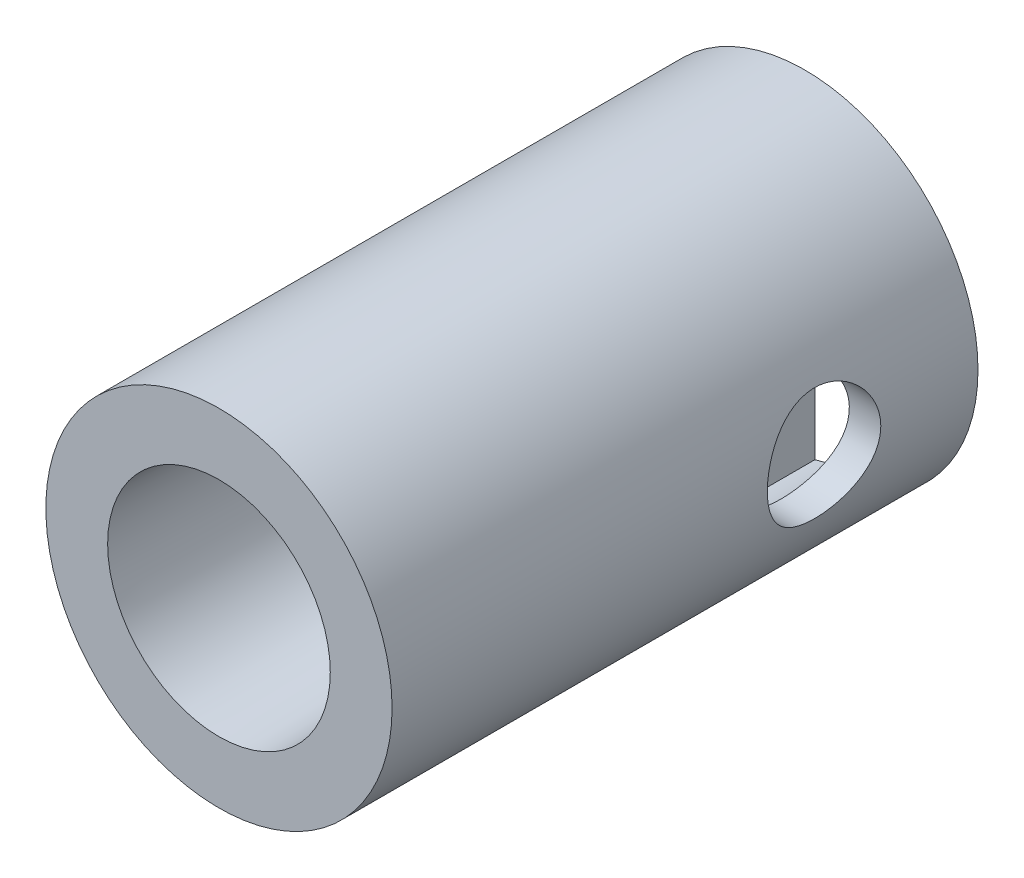
ISO-10303-21;
HEADER;
FILE_DESCRIPTION(('STEP AP214'),'2;1');
FILE_NAME('part.step','',(''),(''),'','','');
FILE_SCHEMA(('AUTOMOTIVE_DESIGN { 1 0 10303 214 1 1 1 1 }'));
ENDSEC;
DATA;
#1=APPLICATION_CONTEXT('core data for automotive mechanical design processes');
#2=APPLICATION_PROTOCOL_DEFINITION('international standard','automotive_design',2000,#1);
#3=PRODUCT_CONTEXT('',#1,'mechanical');
#4=PRODUCT('Part','Part','',(#3));
#5=PRODUCT_RELATED_PRODUCT_CATEGORY('part','',(#4));
#6=PRODUCT_DEFINITION_FORMATION('','',#4);
#7=PRODUCT_DEFINITION_CONTEXT('part definition',#1,'design');
#8=PRODUCT_DEFINITION('design','',#6,#7);
#9=PRODUCT_DEFINITION_SHAPE('','',#8);
#10=(LENGTH_UNIT() NAMED_UNIT(*) SI_UNIT(.MILLI.,.METRE.));
#11=(NAMED_UNIT(*) PLANE_ANGLE_UNIT() SI_UNIT($,.RADIAN.));
#12=(NAMED_UNIT(*) SI_UNIT($,.STERADIAN.) SOLID_ANGLE_UNIT());
#13=UNCERTAINTY_MEASURE_WITH_UNIT(LENGTH_MEASURE(1.E-05),#10,'distance_accuracy_value','');
#14=(GEOMETRIC_REPRESENTATION_CONTEXT(3) GLOBAL_UNCERTAINTY_ASSIGNED_CONTEXT((#13)) GLOBAL_UNIT_ASSIGNED_CONTEXT((#10,
#11,#12)) REPRESENTATION_CONTEXT('',''));
#15=CARTESIAN_POINT('',(0.,0.,0.));
#16=DIRECTION('',(0.,0.,1.));
#17=DIRECTION('',(1.,0.,0.));
#18=AXIS2_PLACEMENT_3D('',#15,#16,#17);
#19=CARTESIAN_POINT('',(0.,0.,-7.62));
#20=DIRECTION('',(0.,0.,1.));
#21=DIRECTION('',(1.,0.,0.));
#22=AXIS2_PLACEMENT_3D('',#19,#20,#21);
#23=CYLINDRICAL_SURFACE('',#22,4.1275);
#24=CARTESIAN_POINT('',(4.1275,0.,-2.59745000000002));
#25=CARTESIAN_POINT('',(4.12750003377303,-0.0738699150357999,-2.59744989833106));
#26=CARTESIAN_POINT('',(4.12549851751913,-0.147739742968134,-2.60352140105543));
#27=CARTESIAN_POINT('',(4.11771093203486,-0.293307842141043,-2.62757563364865));
#28=CARTESIAN_POINT('',(4.11192434338906,-0.365005813930477,-2.64555999829219));
#29=CARTESIAN_POINT('',(4.09719631094705,-0.504110449547072,-2.69276029126061));
#30=CARTESIAN_POINT('',(4.08826003607509,-0.57152393194815,-2.72195782473892));
#31=CARTESIAN_POINT('',(4.06814766170301,-0.700497479140865,-2.79067384573419));
#32=CARTESIAN_POINT('',(4.05697114409457,-0.762056448106838,-2.83019426028284));
#33=CARTESIAN_POINT('',(4.03313723386036,-0.879642319343135,-2.9198299187299));
#34=CARTESIAN_POINT('',(4.02044524001777,-0.93544517836053,-2.97022981851224));
#35=CARTESIAN_POINT('',(3.99520394513136,-1.03797650568563,-3.07958833431013));
#36=CARTESIAN_POINT('',(3.98265467463945,-1.08470306426882,-3.13854874697391));
#37=CARTESIAN_POINT('',(3.95874161721219,-1.16901645282055,-3.26535014716955));
#38=CARTESIAN_POINT('',(3.94742014742756,-1.20631519306968,-3.33339143948426));
#39=CARTESIAN_POINT('',(3.92776908425933,-1.2688453208089,-3.47521200419348));
#40=CARTESIAN_POINT('',(3.91943861293821,-1.29408025007018,-3.54898958508689));
#41=CARTESIAN_POINT('',(3.90707642970345,-1.33093164517486,-3.69764597428655));
#42=CARTESIAN_POINT('',(3.90291295160255,-1.34296678429838,-3.77240971787548));
#43=CARTESIAN_POINT('',(3.89896600281,-1.35438558026996,-3.92300232181736));
#44=CARTESIAN_POINT('',(3.89918123207651,-1.35377299223789,-3.99883085935065));
#45=CARTESIAN_POINT('',(3.90385167568759,-1.34023945235267,-4.14586006535332));
#46=CARTESIAN_POINT('',(3.90812003884548,-1.32786089210651,-4.2171176158935));
#47=CARTESIAN_POINT('',(3.92011067542915,-1.29203011633045,-4.35648249864518));
#48=CARTESIAN_POINT('',(3.92783334942604,-1.26857661650342,-4.42458946449547));
#49=CARTESIAN_POINT('',(3.94599835042475,-1.21089901764405,-4.55696862624955));
#50=CARTESIAN_POINT('',(3.95648147908106,-1.1765115742628,-4.6211638125087));
#51=CARTESIAN_POINT('',(3.97896867021257,-1.09805562115887,-4.74304590103678));
#52=CARTESIAN_POINT('',(3.99097315964902,-1.05398439117884,-4.80073096765264));
#53=CARTESIAN_POINT('',(4.01588959164268,-0.954791266338912,-4.91100838577247));
#54=CARTESIAN_POINT('',(4.02881679311061,-0.899224729328923,-4.96319813452945));
#55=CARTESIAN_POINT('',(4.05359219233949,-0.779968526733568,-5.05762152278044));
#56=CARTESIAN_POINT('',(4.06544029339174,-0.716278134315884,-5.09985427046844));
#57=CARTESIAN_POINT('',(4.08686910256143,-0.581749904505833,-5.17347454716784));
#58=CARTESIAN_POINT('',(4.09642768407982,-0.510851068262228,-5.20475749232888));
#59=CARTESIAN_POINT('',(4.11204011774203,-0.364409666868883,-5.25482932174091));
#60=CARTESIAN_POINT('',(4.11809514465749,-0.288868667685124,-5.27362239426678));
#61=CARTESIAN_POINT('',(4.12582515760304,-0.138698097383655,-5.29747536514225));
#62=CARTESIAN_POINT('',(4.12767363211271,-0.0641637925669669,-5.30307955832262));
#63=CARTESIAN_POINT('',(4.12730059175535,0.0847929999539967,-5.30194178104689));
#64=CARTESIAN_POINT('',(4.12507973793907,0.15921550385449,-5.29520181586411));
#65=CARTESIAN_POINT('',(4.11693197006697,0.303679521169446,-5.26999954954156));
#66=CARTESIAN_POINT('',(4.11110985494714,0.373785312850685,-5.25186850914119));
#67=CARTESIAN_POINT('',(4.0964515888879,0.509934183004496,-5.20481016898131));
#68=CARTESIAN_POINT('',(4.0876150563292,0.575976745830183,-5.17588150221994));
#69=CARTESIAN_POINT('',(4.06754459175,0.704022872399804,-5.10721951416896));
#70=CARTESIAN_POINT('',(4.05625468135755,0.765878240951156,-5.06722665330281));
#71=CARTESIAN_POINT('',(4.03256066801579,0.882178568603146,-4.97787818430306));
#72=CARTESIAN_POINT('',(4.02015623561259,0.936621324485693,-4.92851980288604));
#73=CARTESIAN_POINT('',(3.99494340875978,1.0390325205673,-4.81928107104091));
#74=CARTESIAN_POINT('',(3.98214113699842,1.08661262666917,-4.75903437647707));
#75=CARTESIAN_POINT('',(3.95814009409445,1.17103193604351,-4.6311357609411));
#76=CARTESIAN_POINT('',(3.9469413242912,1.20787113034444,-4.56348383378368));
#77=CARTESIAN_POINT('',(3.92752955296204,1.26957379868481,-4.42271720062233));
#78=CARTESIAN_POINT('',(3.91930881643272,1.29446835261068,-4.34961724995341));
#79=CARTESIAN_POINT('',(3.90688914995954,1.33148868898019,-4.19993307948466));
#80=CARTESIAN_POINT('',(3.90268848803524,1.34361997048565,-4.12335037508017));
#81=CARTESIAN_POINT('',(3.8989770648129,1.35434961350547,-3.97296737370933));
#82=CARTESIAN_POINT('',(3.89924365730875,1.35359040581163,-3.8992178828503));
#83=CARTESIAN_POINT('',(3.90388887279209,1.3401333583877,-3.75295497524842));
#84=CARTESIAN_POINT('',(3.90826726641492,1.32743618458173,-3.68044148978837));
#85=CARTESIAN_POINT('',(3.92047971300071,1.29091178098353,-3.53998399867842));
#86=CARTESIAN_POINT('',(3.92825112226203,1.26728587366939,-3.47198177180556));
#87=CARTESIAN_POINT('',(3.946352726057,1.20973637764597,-3.34085366950138));
#88=CARTESIAN_POINT('',(3.95668347611173,1.17581055291357,-3.27772885665118));
#89=CARTESIAN_POINT('',(3.9792861338334,1.09694412929086,-3.15524649721674));
#90=CARTESIAN_POINT('',(3.99162178931489,1.0515973803027,-3.09616229395152));
#91=CARTESIAN_POINT('',(4.016570318055,0.951870655228976,-2.98623438247757));
#92=CARTESIAN_POINT('',(4.02918326764065,0.897488164285621,-2.93539297623691));
#93=CARTESIAN_POINT('',(4.05382815464096,0.778804109728653,-2.8414919329818));
#94=CARTESIAN_POINT('',(4.06582104978419,0.714208912589858,-2.79879193864743));
#95=CARTESIAN_POINT('',(4.08735441946401,0.578367883935806,-2.72490605244016));
#96=CARTESIAN_POINT('',(4.09689561621736,0.507124019422043,-2.69371676857982));
#97=CARTESIAN_POINT('',(4.11200271625694,0.36409938000074,-2.64531573874334));
#98=CARTESIAN_POINT('',(4.11776052450886,0.292569784741452,-2.6274219105106));
#99=CARTESIAN_POINT('',(4.12550867074236,0.147359729749985,-2.6034905986324));
#100=CARTESIAN_POINT('',(4.12749996631388,0.0736798215471191,-2.59745010140734));
#101=CARTESIAN_POINT('',(4.1275,0.,-2.59745000000002));
#102=B_SPLINE_CURVE_WITH_KNOTS('',3,(#24,#25,#26,#27,#28,#29,#30,#31,#32,#33,#34,#35,#36,#37,
#38,#39,#40,#41,#42,#43,#44,#45,#46,#47,#48,#49,#50,#51,#52,#53,#54,#55,#56,#57,#58,#59,#60,#61,
#62,#63,#64,#65,#66,#67,#68,#69,#70,#71,#72,#73,#74,#75,#76,#77,#78,#79,#80,#81,#82,#83,#84,#85,
#86,#87,#88,#89,#90,#91,#92,#93,#94,#95,#96,#97,#98,#99,#100,#101),.UNSPECIFIED.,.T.,.F.,(4,2,2,
2,2,2,2,2,2,2,2,2,2,2,2,2,2,2,2,2,2,2,2,2,2,2,2,2,2,2,2,2,2,2,2,2,2,2,4),(0.,0.221338694739596,
0.442707769574037,0.663715236079267,0.88476398884369,1.1125082505086,1.34030037956122,
1.57438421247804,1.80839927928949,2.03475554212225,2.26104460057435,2.47738357360788,
2.69374764039304,2.91350920510758,3.13333258180058,3.36422297319685,3.59513403660882,
3.82819397466244,4.06117572038448,4.28435972454561,4.5075074763176,4.72444856839691,
4.94141713498862,5.16398431933184,5.38661751259313,5.61900825462208,5.85139919075892,
6.08318212298764,6.3148651504857,6.53503710197037,6.755196772543,6.97145310356351,
7.18775641557654,7.41323402266546,7.63877449087985,7.87270125125047,8.1065590227084,
8.32738428417254,8.54815339595482),.UNSPECIFIED.);
#103=CARTESIAN_POINT('',(4.1275,0.,-2.59745000000002));
#104=VERTEX_POINT('',#103);
#105=EDGE_CURVE('E136',#104,#104,#102,.T.);
#106=ORIENTED_EDGE('',*,*,#105,.F.);
#107=EDGE_LOOP('',(#106));
#108=FACE_BOUND('',#107,.T.);
#109=CARTESIAN_POINT('',(-4.1275,0.,-2.59745000000002));
#110=CARTESIAN_POINT('',(-4.12750003377303,0.0738699150357999,-2.59744989833106));
#111=CARTESIAN_POINT('',(-4.12549851751913,0.147739742968134,-2.60352140105543));
#112=CARTESIAN_POINT('',(-4.11771093203486,0.293307842141043,-2.62757563364865));
#113=CARTESIAN_POINT('',(-4.11192434338906,0.365005813930477,-2.64555999829219));
#114=CARTESIAN_POINT('',(-4.09719631094705,0.504110449547072,-2.69276029126061));
#115=CARTESIAN_POINT('',(-4.08826003607509,0.57152393194815,-2.72195782473892));
#116=CARTESIAN_POINT('',(-4.06814766170301,0.700497479140865,-2.79067384573419));
#117=CARTESIAN_POINT('',(-4.05697114409457,0.762056448106837,-2.83019426028284));
#118=CARTESIAN_POINT('',(-4.03313723386036,0.879642319343135,-2.9198299187299));
#119=CARTESIAN_POINT('',(-4.02044524001777,0.93544517836053,-2.97022981851224));
#120=CARTESIAN_POINT('',(-3.99520394513136,1.03797650568563,-3.07958833431013));
#121=CARTESIAN_POINT('',(-3.98265467463945,1.08470306426882,-3.13854874697391));
#122=CARTESIAN_POINT('',(-3.95874161721219,1.16901645282055,-3.26535014716955));
#123=CARTESIAN_POINT('',(-3.94742014742756,1.20631519306968,-3.33339143948426));
#124=CARTESIAN_POINT('',(-3.92776908425933,1.2688453208089,-3.47521200419348));
#125=CARTESIAN_POINT('',(-3.91943861293821,1.29408025007018,-3.54898958508689));
#126=CARTESIAN_POINT('',(-3.90707642970345,1.33093164517486,-3.69764597428655));
#127=CARTESIAN_POINT('',(-3.90291295160255,1.34296678429838,-3.77240971787548));
#128=CARTESIAN_POINT('',(-3.89896600281,1.35438558026996,-3.92300232181736));
#129=CARTESIAN_POINT('',(-3.89918123207651,1.35377299223789,-3.99883085935065));
#130=CARTESIAN_POINT('',(-3.90385167568759,1.34023945235267,-4.14586006535332));
#131=CARTESIAN_POINT('',(-3.90812003884548,1.32786089210651,-4.2171176158935));
#132=CARTESIAN_POINT('',(-3.92011067542914,1.29203011633045,-4.35648249864518));
#133=CARTESIAN_POINT('',(-3.92783334942604,1.26857661650342,-4.42458946449547));
#134=CARTESIAN_POINT('',(-3.94599835042475,1.21089901764405,-4.55696862624955));
#135=CARTESIAN_POINT('',(-3.95648147908106,1.1765115742628,-4.6211638125087));
#136=CARTESIAN_POINT('',(-3.97896867021257,1.09805562115887,-4.74304590103678));
#137=CARTESIAN_POINT('',(-3.99097315964902,1.05398439117884,-4.80073096765264));
#138=CARTESIAN_POINT('',(-4.01588959164268,0.954791266338913,-4.91100838577247));
#139=CARTESIAN_POINT('',(-4.02881679311061,0.899224729328923,-4.96319813452945));
#140=CARTESIAN_POINT('',(-4.05359219233949,0.779968526733569,-5.05762152278044));
#141=CARTESIAN_POINT('',(-4.06544029339174,0.716278134315884,-5.09985427046844));
#142=CARTESIAN_POINT('',(-4.08686910256143,0.581749904505834,-5.17347454716784));
#143=CARTESIAN_POINT('',(-4.09642768407982,0.510851068262229,-5.20475749232888));
#144=CARTESIAN_POINT('',(-4.11204011774203,0.364409666868885,-5.25482932174091));
#145=CARTESIAN_POINT('',(-4.11809514465749,0.288868667685125,-5.27362239426678));
#146=CARTESIAN_POINT('',(-4.12582515760304,0.138698097383656,-5.29747536514225));
#147=CARTESIAN_POINT('',(-4.12767363211271,0.0641637925669679,-5.30307955832262));
#148=CARTESIAN_POINT('',(-4.12730059175535,-0.0847929999539957,-5.30194178104689));
#149=CARTESIAN_POINT('',(-4.12507973793907,-0.159215503854489,-5.29520181586411));
#150=CARTESIAN_POINT('',(-4.11693197006697,-0.303679521169446,-5.26999954954156));
#151=CARTESIAN_POINT('',(-4.11110985494714,-0.373785312850685,-5.25186850914119));
#152=CARTESIAN_POINT('',(-4.0964515888879,-0.509934183004496,-5.20481016898131));
#153=CARTESIAN_POINT('',(-4.0876150563292,-0.575976745830183,-5.17588150221994));
#154=CARTESIAN_POINT('',(-4.06754459175,-0.704022872399804,-5.10721951416896));
#155=CARTESIAN_POINT('',(-4.05625468135755,-0.765878240951156,-5.06722665330281));
#156=CARTESIAN_POINT('',(-4.03256066801579,-0.882178568603145,-4.97787818430306));
#157=CARTESIAN_POINT('',(-4.02015623561259,-0.936621324485692,-4.92851980288604));
#158=CARTESIAN_POINT('',(-3.99494340875978,-1.0390325205673,-4.81928107104091));
#159=CARTESIAN_POINT('',(-3.98214113699842,-1.08661262666917,-4.75903437647707));
#160=CARTESIAN_POINT('',(-3.95814009409445,-1.17103193604351,-4.6311357609411));
#161=CARTESIAN_POINT('',(-3.9469413242912,-1.20787113034444,-4.56348383378368));
#162=CARTESIAN_POINT('',(-3.92752955296204,-1.26957379868481,-4.42271720062233));
#163=CARTESIAN_POINT('',(-3.91930881643272,-1.29446835261068,-4.34961724995341));
#164=CARTESIAN_POINT('',(-3.90688914995954,-1.33148868898019,-4.19993307948466));
#165=CARTESIAN_POINT('',(-3.90268848803524,-1.34361997048565,-4.12335037508017));
#166=CARTESIAN_POINT('',(-3.8989770648129,-1.35434961350547,-3.97296737370933));
#167=CARTESIAN_POINT('',(-3.89924365730875,-1.35359040581163,-3.8992178828503));
#168=CARTESIAN_POINT('',(-3.90388887279209,-1.3401333583877,-3.75295497524842));
#169=CARTESIAN_POINT('',(-3.90826726641492,-1.32743618458173,-3.68044148978837));
#170=CARTESIAN_POINT('',(-3.92047971300071,-1.29091178098353,-3.53998399867843));
#171=CARTESIAN_POINT('',(-3.92825112226203,-1.26728587366939,-3.47198177180556));
#172=CARTESIAN_POINT('',(-3.946352726057,-1.20973637764597,-3.34085366950138));
#173=CARTESIAN_POINT('',(-3.95668347611173,-1.17581055291357,-3.27772885665118));
#174=CARTESIAN_POINT('',(-3.9792861338334,-1.09694412929086,-3.15524649721674));
#175=CARTESIAN_POINT('',(-3.99162178931489,-1.0515973803027,-3.09616229395152));
#176=CARTESIAN_POINT('',(-4.016570318055,-0.951870655228977,-2.98623438247757));
#177=CARTESIAN_POINT('',(-4.02918326764065,-0.897488164285622,-2.93539297623691));
#178=CARTESIAN_POINT('',(-4.05382815464096,-0.778804109728654,-2.8414919329818));
#179=CARTESIAN_POINT('',(-4.06582104978419,-0.714208912589858,-2.79879193864743));
#180=CARTESIAN_POINT('',(-4.08735441946401,-0.578367883935806,-2.72490605244017));
#181=CARTESIAN_POINT('',(-4.09689561621736,-0.507124019422043,-2.69371676857982));
#182=CARTESIAN_POINT('',(-4.11200271625694,-0.36409938000074,-2.64531573874334));
#183=CARTESIAN_POINT('',(-4.11776052450886,-0.292569784741453,-2.6274219105106));
#184=CARTESIAN_POINT('',(-4.12550867074236,-0.147359729749986,-2.6034905986324));
#185=CARTESIAN_POINT('',(-4.12749996631388,-0.0736798215471197,-2.59745010140734));
#186=CARTESIAN_POINT('',(-4.1275,0.,-2.59745000000002));
#187=B_SPLINE_CURVE_WITH_KNOTS('',3,(#109,#110,#111,#112,#113,#114,#115,#116,#117,#118,#119,
#120,#121,#122,#123,#124,#125,#126,#127,#128,#129,#130,#131,#132,#133,#134,#135,#136,#137,#138,
#139,#140,#141,#142,#143,#144,#145,#146,#147,#148,#149,#150,#151,#152,#153,#154,#155,#156,#157,
#158,#159,#160,#161,#162,#163,#164,#165,#166,#167,#168,#169,#170,#171,#172,#173,#174,#175,#176,
#177,#178,#179,#180,#181,#182,#183,#184,#185,#186),.UNSPECIFIED.,.T.,.F.,(4,2,2,2,2,2,2,2,2,2,2,
2,2,2,2,2,2,2,2,2,2,2,2,2,2,2,2,2,2,2,2,2,2,2,2,2,2,2,4),(0.,0.221338694739596,
0.442707769574037,0.663715236079266,0.88476398884369,1.1125082505086,1.34030037956122,
1.57438421247804,1.80839927928949,2.03475554212225,2.26104460057435,2.47738357360788,
2.69374764039304,2.91350920510758,3.13333258180058,3.36422297319685,3.59513403660882,
3.82819397466244,4.06117572038448,4.28435972454561,4.5075074763176,4.72444856839691,
4.94141713498862,5.16398431933184,5.38661751259313,5.61900825462207,5.85139919075892,
6.08318212298764,6.3148651504857,6.53503710197037,6.755196772543,6.97145310356351,
7.18775641557654,7.41323402266546,7.63877449087985,7.87270125125047,8.1065590227084,
8.32738428417254,8.54815339595482),.UNSPECIFIED.);
#188=CARTESIAN_POINT('',(-4.1275,0.,-2.59745000000002));
#189=VERTEX_POINT('',#188);
#190=EDGE_CURVE('E128',#189,#189,#187,.T.);
#191=ORIENTED_EDGE('',*,*,#190,.F.);
#192=EDGE_LOOP('',(#191));
#193=FACE_BOUND('',#192,.T.);
#194=CARTESIAN_POINT('',(0.,0.,-7.62));
#195=DIRECTION('',(0.,0.,1.));
#196=DIRECTION('',(1.,0.,0.));
#197=AXIS2_PLACEMENT_3D('',#194,#195,#196);
#198=CIRCLE('',#197,4.1275);
#199=CARTESIAN_POINT('',(4.1275,0.,-7.62));
#200=VERTEX_POINT('',#199);
#201=EDGE_CURVE('E125',#200,#200,#198,.T.);
#202=ORIENTED_EDGE('',*,*,#201,.T.);
#203=EDGE_LOOP('',(#202));
#204=FACE_BOUND('',#203,.T.);
#205=CARTESIAN_POINT('',(0.,0.,6.35));
#206=DIRECTION('',(0.,0.,1.));
#207=DIRECTION('',(1.,0.,0.));
#208=AXIS2_PLACEMENT_3D('',#205,#206,#207);
#209=CIRCLE('',#208,4.1275);
#210=CARTESIAN_POINT('',(4.1275,0.,6.35));
#211=VERTEX_POINT('',#210);
#212=EDGE_CURVE('E120',#211,#211,#209,.T.);
#213=ORIENTED_EDGE('',*,*,#212,.F.);
#214=EDGE_LOOP('',(#213));
#215=FACE_BOUND('',#214,.T.);
#216=ADVANCED_FACE('F32',(#108,#193,#204,#215),#23,.T.);
#217=CARTESIAN_POINT('',(0.,0.,-7.62));
#218=DIRECTION('',(0.,0.,1.));
#219=DIRECTION('',(1.,0.,0.));
#220=AXIS2_PLACEMENT_3D('',#217,#218,#219);
#221=PLANE('',#220);
#222=DIRECTION('',(0.,-1.,0.));
#223=VECTOR('',#222,1.);
#224=CARTESIAN_POINT('',(0.237999999964339,0.,-7.62));
#225=LINE('',#224,#223);
#226=CARTESIAN_POINT('',(0.237999999964339,3.87805323324025,-7.62));
#227=VERTEX_POINT('',#226);
#228=CARTESIAN_POINT('',(0.237999999964339,-3.87805323324025,-7.62));
#229=VERTEX_POINT('',#228);
#230=EDGE_CURVE('E204',#227,#229,#225,.T.);
#231=ORIENTED_EDGE('',*,*,#230,.T.);
#232=CARTESIAN_POINT('',(0.,0.,-7.62));
#233=DIRECTION('',(0.,0.,1.));
#234=DIRECTION('',(1.,0.,0.));
#235=AXIS2_PLACEMENT_3D('',#232,#233,#234);
#236=CIRCLE('',#235,3.88534951836102);
#237=EDGE_CURVE('E254',#229,#227,#236,.T.);
#238=ORIENTED_EDGE('',*,*,#237,.T.);
#239=EDGE_LOOP('',(#231,#238));
#240=FACE_BOUND('',#239,.T.);
#241=DIRECTION('',(0.,1.,0.));
#242=VECTOR('',#241,1.);
#243=CARTESIAN_POINT('',(-0.237999999964365,0.,-7.62));
#244=LINE('',#243,#242);
#245=CARTESIAN_POINT('',(-0.237999999964334,-3.87805323324026,-7.62));
#246=VERTEX_POINT('',#245);
#247=CARTESIAN_POINT('',(-0.237999999964395,3.87805323324025,-7.62));
#248=VERTEX_POINT('',#247);
#249=EDGE_CURVE('E209',#246,#248,#244,.T.);
#250=ORIENTED_EDGE('',*,*,#249,.T.);
#251=CARTESIAN_POINT('',(0.,0.,-7.62));
#252=DIRECTION('',(0.,0.,1.));
#253=DIRECTION('',(1.,0.,0.));
#254=AXIS2_PLACEMENT_3D('',#251,#252,#253);
#255=CIRCLE('',#254,3.88534951836102);
#256=EDGE_CURVE('E215',#248,#246,#255,.T.);
#257=ORIENTED_EDGE('',*,*,#256,.T.);
#258=EDGE_LOOP('',(#250,#257));
#259=FACE_BOUND('',#258,.T.);
#260=ORIENTED_EDGE('',*,*,#201,.F.);
#261=EDGE_LOOP('',(#260));
#262=FACE_BOUND('',#261,.T.);
#263=ADVANCED_FACE('F193',(#240,#259,#262),#221,.F.);
#264=CARTESIAN_POINT('',(0.,0.,6.35));
#265=DIRECTION('',(0.,0.,1.));
#266=DIRECTION('',(1.,0.,0.));
#267=AXIS2_PLACEMENT_3D('',#264,#265,#266);
#268=PLANE('',#267);
#269=CARTESIAN_POINT('',(0.,0.,6.35));
#270=DIRECTION('',(0.,0.,1.));
#271=DIRECTION('',(1.,0.,0.));
#272=AXIS2_PLACEMENT_3D('',#269,#270,#271);
#273=CIRCLE('',#272,2.65430000000001);
#274=CARTESIAN_POINT('',(2.65430000000001,0.,6.35));
#275=VERTEX_POINT('',#274);
#276=EDGE_CURVE('E292',#275,#275,#273,.T.);
#277=ORIENTED_EDGE('',*,*,#276,.F.);
#278=EDGE_LOOP('',(#277));
#279=FACE_BOUND('',#278,.T.);
#280=ORIENTED_EDGE('',*,*,#212,.T.);
#281=EDGE_LOOP('',(#280));
#282=FACE_BOUND('',#281,.T.);
#283=ADVANCED_FACE('F190',(#279,#282),#268,.T.);
#284=CARTESIAN_POINT('',(0.,0.,0.254));
#285=DIRECTION('',(0.,0.,-1.));
#286=DIRECTION('',(-1.,0.,0.));
#287=AXIS2_PLACEMENT_3D('',#284,#285,#286);
#288=CYLINDRICAL_SURFACE('',#287,3.37734951836102);
#289=CARTESIAN_POINT('',(3.377349518361,0.,-2.59745000000002));
#290=CARTESIAN_POINT('',(3.37734455893801,-0.0726879603993307,-2.59745670113855));
#291=CARTESIAN_POINT('',(3.3749754121588,-0.145501754067376,-2.60334448081282));
#292=CARTESIAN_POINT('',(3.36572936472338,-0.289076594485013,-2.62669151385157));
#293=CARTESIAN_POINT('',(3.35884022376242,-0.359831520832319,-2.64418218970048));
#294=CARTESIAN_POINT('',(3.34129652057807,-0.496980445181198,-2.6899964328775));
#295=CARTESIAN_POINT('',(3.33065430669533,-0.563387907702961,-2.71828449951982));
#296=CARTESIAN_POINT('',(3.30665231843669,-0.690454122340064,-2.78474946593264));
#297=CARTESIAN_POINT('',(3.29329348433511,-0.751114852889425,-2.82292294541892));
#298=CARTESIAN_POINT('',(3.26450369417738,-0.867916269940759,-2.90997908626384));
#299=CARTESIAN_POINT('',(3.24900831952552,-0.92375024468204,-2.95925180316873));
#300=CARTESIAN_POINT('',(3.21798537494595,-1.02662193466756,-3.06628444009257));
#301=CARTESIAN_POINT('',(3.2024577929844,-1.07365533745846,-3.12404849640862));
#302=CARTESIAN_POINT('',(3.17235771440744,-1.15965848818485,-3.24955505023476));
#303=CARTESIAN_POINT('',(3.15785878299854,-1.19817461295903,-3.3176278523472));
#304=CARTESIAN_POINT('',(3.13246851019508,-1.26307336631158,-3.45995315227106));
#305=CARTESIAN_POINT('',(3.12157545194092,-1.28946177157609,-3.53420268802924));
#306=CARTESIAN_POINT('',(3.10532202021268,-1.32811486344044,-3.68324949588683));
#307=CARTESIAN_POINT('',(3.09973275290331,-1.3409667950175,-3.75786860010593));
#308=CARTESIAN_POINT('',(3.09405644239227,-1.35401641006485,-3.90839749040783));
#309=CARTESIAN_POINT('',(3.09396668457945,-1.35422033671345,-3.98430662121115));
#310=CARTESIAN_POINT('',(3.09910431962849,-1.34241311777812,-4.12961144040417));
#311=CARTESIAN_POINT('',(3.10396106465943,-1.33125347127481,-4.19909197476133));
#312=CARTESIAN_POINT('',(3.11782225522066,-1.29845590607337,-4.33509616875388));
#313=CARTESIAN_POINT('',(3.12682742639281,-1.27681615416334,-4.40161930884934));
#314=CARTESIAN_POINT('',(3.14816869294297,-1.22326042527972,-4.53142726378506));
#315=CARTESIAN_POINT('',(3.16056909533372,-1.19114349005044,-4.59461812402374));
#316=CARTESIAN_POINT('',(3.18728601810568,-1.11768619906507,-4.71494616313063));
#317=CARTESIAN_POINT('',(3.20160325840467,-1.07634237400319,-4.77208105300755));
#318=CARTESIAN_POINT('',(3.23189211543646,-0.981838697263378,-4.88333516384491));
#319=CARTESIAN_POINT('',(3.2479059515006,-0.928011406512404,-4.93687746372556));
#320=CARTESIAN_POINT('',(3.27884042419239,-0.81197158850267,-5.03436013426776));
#321=CARTESIAN_POINT('',(3.29376084166836,-0.749757387328972,-5.07829858352853));
#322=CARTESIAN_POINT('',(3.32120274920545,-0.617070059110083,-5.15608589110002));
#323=CARTESIAN_POINT('',(3.33367075218945,-0.546457526720523,-5.18971720027674));
#324=CARTESIAN_POINT('',(3.35439845224189,-0.399951162985777,-5.24442498392475));
#325=CARTESIAN_POINT('',(3.36266029205907,-0.324060043157601,-5.26550785188504));
#326=CARTESIAN_POINT('',(3.37365397449798,-0.173986150796277,-5.29335235146548));
#327=CARTESIAN_POINT('',(3.37668475846456,-0.0999690481255243,-5.3008892640588));
#328=CARTESIAN_POINT('',(3.37781686657482,0.0483272370038097,-5.30371775640456));
#329=CARTESIAN_POINT('',(3.37591947221926,0.122606346315279,-5.29901251954855));
#330=CARTESIAN_POINT('',(3.36760402876399,0.265800704340595,-5.27805989208292));
#331=CARTESIAN_POINT('',(3.36139353857108,0.334806830417992,-5.26234215905999));
#332=CARTESIAN_POINT('',(3.34529202924126,0.469138299907494,-5.22053186767743));
#333=CARTESIAN_POINT('',(3.33540053751274,0.534463169454749,-5.19443797712776));
#334=CARTESIAN_POINT('',(3.31252032133695,0.661827485340994,-5.13176468235937));
#335=CARTESIAN_POINT('',(3.29944607229388,0.723705197187519,-5.09488881449074));
#336=CARTESIAN_POINT('',(3.27161710342745,0.840611849377737,-5.01202717648234));
#337=CARTESIAN_POINT('',(3.25686171028516,0.895638027000915,-4.96603775075997));
#338=CARTESIAN_POINT('',(3.22606639965605,1.00109990496621,-4.86268551177141));
#339=CARTESIAN_POINT('',(3.2100060950471,1.05099085508512,-4.80477145447148));
#340=CARTESIAN_POINT('',(3.17931413420026,1.14048036041521,-4.68110997922347));
#341=CARTESIAN_POINT('',(3.1646827159886,1.1800772026368,-4.6153612602009));
#342=CARTESIAN_POINT('',(3.13848055415846,1.24810980091356,-4.47689474264165));
#343=CARTESIAN_POINT('',(3.12694123687643,1.27643228085826,-4.40411491662885));
#344=CARTESIAN_POINT('',(3.10871917236686,1.32019983034665,-4.25421726882825));
#345=CARTESIAN_POINT('',(3.10203282954142,1.33565443502844,-4.17710270441137));
#346=CARTESIAN_POINT('',(3.09479444357629,1.35233580550332,-4.02671648097907));
#347=CARTESIAN_POINT('',(3.09383483340287,1.35450815746289,-3.95356868126008));
#348=CARTESIAN_POINT('',(3.09709043239046,1.34704758507743,-3.80800234618639));
#349=CARTESIAN_POINT('',(3.10130498091472,1.33741616783836,-3.7355837189211));
#350=CARTESIAN_POINT('',(3.11407414223245,1.30739431537574,-3.59648017485822));
#351=CARTESIAN_POINT('',(3.12244965124639,1.28744658934238,-3.52968176867628));
#352=CARTESIAN_POINT('',(3.14247051794192,1.23777307432628,-3.40035345777146));
#353=CARTESIAN_POINT('',(3.15411677899986,1.20804458352277,-3.33782473826891));
#354=CARTESIAN_POINT('',(3.18019617446085,1.1376839528807,-3.21490420690596));
#355=CARTESIAN_POINT('',(3.19475082079299,1.09652432037331,-3.15484053807856));
#356=CARTESIAN_POINT('',(3.22463746723691,1.00523995824943,-3.04217592442501));
#357=CARTESIAN_POINT('',(3.23996970165881,0.955112514728799,-2.98957724737432));
#358=CARTESIAN_POINT('',(3.27088298930818,0.843433837835427,-2.889824080321));
#359=CARTESIAN_POINT('',(3.28641533954396,0.781351572511415,-2.84324637837205));
#360=CARTESIAN_POINT('',(3.31495983817834,0.649663743093335,-2.76115758288441));
#361=CARTESIAN_POINT('',(3.32797081438892,0.580054703114893,-2.72565163195825));
#362=CARTESIAN_POINT('',(3.34978749588014,0.436559671049308,-2.66754498726424));
#363=CARTESIAN_POINT('',(3.35866681625411,0.362777124687557,-2.6447168558467));
#364=CARTESIAN_POINT('',(3.37152173077164,0.212132812966788,-2.6119812773354));
#365=CARTESIAN_POINT('',(3.37551287872877,0.135281622075151,-2.60203284217653));
#366=CARTESIAN_POINT('',(3.37718331491618,0.0388424884196605,-2.59786645479086));
#367=CARTESIAN_POINT('',(3.37735084375864,0.0194257378217498,-2.59744820913177));
#368=CARTESIAN_POINT('',(3.377349518361,0.,-2.59745000000002));
#369=B_SPLINE_CURVE_WITH_KNOTS('',3,(#289,#290,#291,#292,#293,#294,#295,#296,#297,#298,#299,
#300,#301,#302,#303,#304,#305,#306,#307,#308,#309,#310,#311,#312,#313,#314,#315,#316,#317,#318,
#319,#320,#321,#322,#323,#324,#325,#326,#327,#328,#329,#330,#331,#332,#333,#334,#335,#336,#337,
#338,#339,#340,#341,#342,#343,#344,#345,#346,#347,#348,#349,#350,#351,#352,#353,#354,#355,#356,
#357,#358,#359,#360,#361,#362,#363,#364,#365,#366,#367,#368),.UNSPECIFIED.,.T.,.F.,(4,2,2,2,2,2,
2,2,2,2,2,2,2,2,2,2,2,2,2,2,2,2,2,2,2,2,2,2,2,2,2,2,2,2,2,2,2,2,2,4),(0.,0.218011892515729,
0.436616619362822,0.654508703274225,0.872325498530129,1.09951262502911,1.32681078780078,
1.564254368245,1.80158473183413,2.02813181953245,2.2545670804931,2.4651993791866,
2.67586853563718,2.89084271907539,3.10589786928513,3.3376205237805,3.56938949567532,
3.80575825939139,4.04200648880413,4.26424181348107,4.48641935489464,4.69858530505068,
4.91077850389353,5.12946577447911,5.34824094196265,5.58149371405557,5.81478527573461,
6.05036494317557,6.28576988955526,6.50420020974514,6.72260264364409,6.93232699228293,
7.14210932350715,7.36392116179602,7.58580024029735,7.82211385753634,8.0585370749086,
8.29056927914038,8.52186123918699,8.58012455876244),.UNSPECIFIED.);
#370=CARTESIAN_POINT('',(3.377349518361,0.,-2.59745000000002));
#371=VERTEX_POINT('',#370);
#372=EDGE_CURVE('E167',#371,#371,#369,.T.);
#373=ORIENTED_EDGE('',*,*,#372,.T.);
#374=EDGE_LOOP('',(#373));
#375=FACE_BOUND('',#374,.T.);
#376=DIRECTION('',(0.,0.,-1.));
#377=VECTOR('',#376,1.);
#378=CARTESIAN_POINT('',(0.745999999964338,3.29392983671884,0.254));
#379=LINE('',#378,#377);
#380=CARTESIAN_POINT('',(0.745999999964338,3.29392983671884,0.254));
#381=VERTEX_POINT('',#380);
#382=CARTESIAN_POINT('',(0.745999999964338,3.29392983671884,-7.112));
#383=VERTEX_POINT('',#382);
#384=EDGE_CURVE('E117',#381,#383,#379,.T.);
#385=ORIENTED_EDGE('',*,*,#384,.T.);
#386=CARTESIAN_POINT('',(0.,0.,-7.112));
#387=DIRECTION('',(0.,0.,1.));
#388=DIRECTION('',(1.,0.,0.));
#389=AXIS2_PLACEMENT_3D('',#386,#387,#388);
#390=CIRCLE('',#389,3.37734951836102);
#391=CARTESIAN_POINT('',(0.745999999964338,-3.29392983671884,-7.112));
#392=VERTEX_POINT('',#391);
#393=EDGE_CURVE('E218',#383,#392,#390,.F.);
#394=ORIENTED_EDGE('',*,*,#393,.T.);
#395=DIRECTION('',(0.,0.,-1.));
#396=VECTOR('',#395,1.);
#397=CARTESIAN_POINT('',(0.745999999964338,-3.29392983671884,0.254));
#398=LINE('',#397,#396);
#399=CARTESIAN_POINT('',(0.745999999964338,-3.29392983671884,0.254));
#400=VERTEX_POINT('',#399);
#401=EDGE_CURVE('E116',#400,#392,#398,.T.);
#402=ORIENTED_EDGE('',*,*,#401,.F.);
#403=CARTESIAN_POINT('',(0.,0.,0.254));
#404=DIRECTION('',(0.,0.,-1.));
#405=DIRECTION('',(-1.,0.,0.));
#406=AXIS2_PLACEMENT_3D('',#403,#404,#405);
#407=CIRCLE('',#406,3.37734951836102);
#408=EDGE_CURVE('E109',#381,#400,#407,.T.);
#409=ORIENTED_EDGE('',*,*,#408,.F.);
#410=EDGE_LOOP('',(#385,#394,#402,#409));
#411=FACE_BOUND('',#410,.T.);
#412=ADVANCED_FACE('F185',(#375,#411),#288,.F.);
#413=CARTESIAN_POINT('',(0.745999999964338,-3.29392983671884,0.254));
#414=DIRECTION('',(-1.,0.,0.));
#415=DIRECTION('',(0.,0.,1.));
#416=AXIS2_PLACEMENT_3D('',#413,#414,#415);
#417=PLANE('',#416);
#418=CARTESIAN_POINT('',(0.745999999964339,0.,-3.95000000000001));
#419=DIRECTION('',(-1.,0.,0.));
#420=DIRECTION('',(0.,0.,1.));
#421=AXIS2_PLACEMENT_3D('',#418,#419,#420);
#422=CIRCLE('',#421,1.35254999999999);
#423=CARTESIAN_POINT('',(0.745999999964339,0.,-2.59745000000002));
#424=VERTEX_POINT('',#423);
#425=EDGE_CURVE('E103',#424,#424,#422,.T.);
#426=ORIENTED_EDGE('',*,*,#425,.T.);
#427=EDGE_LOOP('',(#426));
#428=FACE_BOUND('',#427,.T.);
#429=ORIENTED_EDGE('',*,*,#401,.T.);
#430=DIRECTION('',(0.,1.,0.));
#431=VECTOR('',#430,1.);
#432=CARTESIAN_POINT('',(0.745999999964338,-3.29392983671884,-7.112));
#433=LINE('',#432,#431);
#434=EDGE_CURVE('E252',#392,#383,#433,.T.);
#435=ORIENTED_EDGE('',*,*,#434,.T.);
#436=ORIENTED_EDGE('',*,*,#384,.F.);
#437=DIRECTION('',(0.,1.,0.));
#438=VECTOR('',#437,1.);
#439=CARTESIAN_POINT('',(0.745999999964338,-3.29392983671884,0.254));
#440=LINE('',#439,#438);
#441=EDGE_CURVE('E113',#400,#381,#440,.T.);
#442=ORIENTED_EDGE('',*,*,#441,.F.);
#443=EDGE_LOOP('',(#429,#435,#436,#442));
#444=FACE_BOUND('',#443,.T.);
#445=ADVANCED_FACE('F182',(#428,#444),#417,.F.);
#446=CARTESIAN_POINT('',(0.,0.,0.254));
#447=DIRECTION('',(0.,0.,-1.));
#448=DIRECTION('',(-1.,0.,0.));
#449=AXIS2_PLACEMENT_3D('',#446,#447,#448);
#450=PLANE('',#449);
#451=ORIENTED_EDGE('',*,*,#408,.T.);
#452=ORIENTED_EDGE('',*,*,#441,.T.);
#453=EDGE_LOOP('',(#451,#452));
#454=FACE_BOUND('',#453,.T.);
#455=ADVANCED_FACE('F178',(#454),#450,.T.);
#456=CARTESIAN_POINT('',(0.,0.,0.254));
#457=DIRECTION('',(0.,0.,-1.));
#458=DIRECTION('',(-1.,0.,0.));
#459=AXIS2_PLACEMENT_3D('',#456,#457,#458);
#460=CYLINDRICAL_SURFACE('',#459,3.37734951836102);
#461=CARTESIAN_POINT('',(-3.37734951836103,0.,-2.59745000000002));
#462=CARTESIAN_POINT('',(-3.37734455893804,0.0726879603993307,-2.59745670113855));
#463=CARTESIAN_POINT('',(-3.37497541215883,0.145501754067376,-2.60334448081282));
#464=CARTESIAN_POINT('',(-3.36572936472341,0.289076594485013,-2.62669151385157));
#465=CARTESIAN_POINT('',(-3.35884022376244,0.359831520832319,-2.64418218970048));
#466=CARTESIAN_POINT('',(-3.34129652057809,0.496980445181198,-2.6899964328775));
#467=CARTESIAN_POINT('',(-3.33065430669536,0.563387907702961,-2.71828449951982));
#468=CARTESIAN_POINT('',(-3.30665231843672,0.690454122340064,-2.78474946593264));
#469=CARTESIAN_POINT('',(-3.29329348433513,0.751114852889425,-2.82292294541892));
#470=CARTESIAN_POINT('',(-3.26450369417741,0.867916269940759,-2.90997908626384));
#471=CARTESIAN_POINT('',(-3.24900831952554,0.92375024468204,-2.95925180316873));
#472=CARTESIAN_POINT('',(-3.21798537494598,1.02662193466756,-3.06628444009257));
#473=CARTESIAN_POINT('',(-3.20245779298443,1.07365533745846,-3.12404849640862));
#474=CARTESIAN_POINT('',(-3.17235771440747,1.15965848818485,-3.24955505023476));
#475=CARTESIAN_POINT('',(-3.15785878299857,1.19817461295903,-3.3176278523472));
#476=CARTESIAN_POINT('',(-3.13246851019511,1.26307336631158,-3.45995315227106));
#477=CARTESIAN_POINT('',(-3.12157545194094,1.28946177157609,-3.53420268802924));
#478=CARTESIAN_POINT('',(-3.10532202021271,1.32811486344044,-3.68324949588683));
#479=CARTESIAN_POINT('',(-3.09973275290334,1.3409667950175,-3.75786860010593));
#480=CARTESIAN_POINT('',(-3.09405644239229,1.35401641006485,-3.90839749040783));
#481=CARTESIAN_POINT('',(-3.09396668457948,1.35422033671345,-3.98430662121115));
#482=CARTESIAN_POINT('',(-3.09910431962851,1.34241311777812,-4.12961144040417));
#483=CARTESIAN_POINT('',(-3.10396106465946,1.33125347127481,-4.19909197476133));
#484=CARTESIAN_POINT('',(-3.11782225522069,1.29845590607337,-4.33509616875388));
#485=CARTESIAN_POINT('',(-3.12682742639284,1.27681615416334,-4.40161930884934));
#486=CARTESIAN_POINT('',(-3.148168692943,1.22326042527972,-4.53142726378506));
#487=CARTESIAN_POINT('',(-3.16056909533375,1.19114349005044,-4.59461812402374));
#488=CARTESIAN_POINT('',(-3.18728601810571,1.11768619906507,-4.71494616313063));
#489=CARTESIAN_POINT('',(-3.2016032584047,1.07634237400319,-4.77208105300755));
#490=CARTESIAN_POINT('',(-3.23189211543649,0.981838697263378,-4.88333516384491));
#491=CARTESIAN_POINT('',(-3.24790595150062,0.928011406512404,-4.93687746372556));
#492=CARTESIAN_POINT('',(-3.27884042419242,0.81197158850267,-5.03436013426776));
#493=CARTESIAN_POINT('',(-3.29376084166838,0.749757387328972,-5.07829858352853));
#494=CARTESIAN_POINT('',(-3.32120274920548,0.617070059110083,-5.15608589110002));
#495=CARTESIAN_POINT('',(-3.33367075218947,0.546457526720523,-5.18971720027674));
#496=CARTESIAN_POINT('',(-3.35439845224192,0.399951162985777,-5.24442498392475));
#497=CARTESIAN_POINT('',(-3.3626602920591,0.324060043157601,-5.26550785188504));
#498=CARTESIAN_POINT('',(-3.37365397449801,0.173986150796277,-5.29335235146548));
#499=CARTESIAN_POINT('',(-3.37668475846459,0.0999690481255243,-5.3008892640588));
#500=CARTESIAN_POINT('',(-3.37781686657485,-0.0483272370038097,-5.30371775640456));
#501=CARTESIAN_POINT('',(-3.37591947221929,-0.122606346315279,-5.29901251954855));
#502=CARTESIAN_POINT('',(-3.36760402876401,-0.265800704340595,-5.27805989208292));
#503=CARTESIAN_POINT('',(-3.36139353857111,-0.334806830417992,-5.26234215905999));
#504=CARTESIAN_POINT('',(-3.34529202924129,-0.469138299907494,-5.22053186767743));
#505=CARTESIAN_POINT('',(-3.33540053751276,-0.534463169454749,-5.19443797712776));
#506=CARTESIAN_POINT('',(-3.31252032133698,-0.661827485340994,-5.13176468235937));
#507=CARTESIAN_POINT('',(-3.29944607229391,-0.723705197187519,-5.09488881449074));
#508=CARTESIAN_POINT('',(-3.27161710342747,-0.840611849377737,-5.01202717648234));
#509=CARTESIAN_POINT('',(-3.25686171028519,-0.895638027000915,-4.96603775075997));
#510=CARTESIAN_POINT('',(-3.22606639965607,-1.00109990496621,-4.86268551177141));
#511=CARTESIAN_POINT('',(-3.21000609504713,-1.05099085508512,-4.80477145447148));
#512=CARTESIAN_POINT('',(-3.17931413420029,-1.14048036041521,-4.68110997922347));
#513=CARTESIAN_POINT('',(-3.16468271598863,-1.1800772026368,-4.6153612602009));
#514=CARTESIAN_POINT('',(-3.13848055415848,-1.24810980091356,-4.47689474264165));
#515=CARTESIAN_POINT('',(-3.12694123687645,-1.27643228085826,-4.40411491662885));
#516=CARTESIAN_POINT('',(-3.10871917236689,-1.32019983034665,-4.25421726882825));
#517=CARTESIAN_POINT('',(-3.10203282954144,-1.33565443502844,-4.17710270441137));
#518=CARTESIAN_POINT('',(-3.09479444357632,-1.35233580550332,-4.02671648097907));
#519=CARTESIAN_POINT('',(-3.09383483340289,-1.35450815746289,-3.95356868126008));
#520=CARTESIAN_POINT('',(-3.09709043239049,-1.34704758507743,-3.80800234618639));
#521=CARTESIAN_POINT('',(-3.10130498091475,-1.33741616783836,-3.7355837189211));
#522=CARTESIAN_POINT('',(-3.11407414223248,-1.30739431537574,-3.59648017485822));
#523=CARTESIAN_POINT('',(-3.12244965124642,-1.28744658934238,-3.52968176867628));
#524=CARTESIAN_POINT('',(-3.14247051794195,-1.23777307432628,-3.40035345777146));
#525=CARTESIAN_POINT('',(-3.15411677899988,-1.20804458352277,-3.33782473826891));
#526=CARTESIAN_POINT('',(-3.18019617446088,-1.1376839528807,-3.21490420690596));
#527=CARTESIAN_POINT('',(-3.19475082079302,-1.09652432037331,-3.15484053807856));
#528=CARTESIAN_POINT('',(-3.22463746723693,-1.00523995824943,-3.04217592442501));
#529=CARTESIAN_POINT('',(-3.23996970165884,-0.955112514728799,-2.98957724737432));
#530=CARTESIAN_POINT('',(-3.27088298930821,-0.843433837835427,-2.889824080321));
#531=CARTESIAN_POINT('',(-3.28641533954399,-0.781351572511415,-2.84324637837205));
#532=CARTESIAN_POINT('',(-3.31495983817836,-0.649663743093335,-2.76115758288441));
#533=CARTESIAN_POINT('',(-3.32797081438895,-0.580054703114893,-2.72565163195825));
#534=CARTESIAN_POINT('',(-3.34978749588017,-0.436559671049308,-2.66754498726424));
#535=CARTESIAN_POINT('',(-3.35866681625413,-0.362777124687557,-2.6447168558467));
#536=CARTESIAN_POINT('',(-3.37152173077167,-0.212132812966788,-2.6119812773354));
#537=CARTESIAN_POINT('',(-3.3755128787288,-0.135281622075151,-2.60203284217653));
#538=CARTESIAN_POINT('',(-3.37718331491621,-0.0388424884196605,-2.59786645479086));
#539=CARTESIAN_POINT('',(-3.37735084375867,-0.0194257378217498,-2.59744820913177));
#540=CARTESIAN_POINT('',(-3.37734951836103,0.,-2.59745000000002));
#541=B_SPLINE_CURVE_WITH_KNOTS('',3,(#461,#462,#463,#464,#465,#466,#467,#468,#469,#470,#471,
#472,#473,#474,#475,#476,#477,#478,#479,#480,#481,#482,#483,#484,#485,#486,#487,#488,#489,#490,
#491,#492,#493,#494,#495,#496,#497,#498,#499,#500,#501,#502,#503,#504,#505,#506,#507,#508,#509,
#510,#511,#512,#513,#514,#515,#516,#517,#518,#519,#520,#521,#522,#523,#524,#525,#526,#527,#528,
#529,#530,#531,#532,#533,#534,#535,#536,#537,#538,#539,#540),.UNSPECIFIED.,.T.,.F.,(4,2,2,2,2,2,
2,2,2,2,2,2,2,2,2,2,2,2,2,2,2,2,2,2,2,2,2,2,2,2,2,2,2,2,2,2,2,2,2,4),(0.,0.218011892515729,
0.436616619362822,0.654508703274225,0.872325498530129,1.09951262502911,1.32681078780078,
1.564254368245,1.80158473183413,2.02813181953245,2.2545670804931,2.4651993791866,
2.67586853563718,2.89084271907539,3.10589786928513,3.3376205237805,3.56938949567532,
3.80575825939139,4.04200648880413,4.26424181348107,4.48641935489464,4.69858530505068,
4.91077850389353,5.12946577447911,5.34824094196265,5.58149371405557,5.81478527573461,
6.05036494317557,6.28576988955526,6.50420020974514,6.72260264364409,6.93232699228293,
7.14210932350715,7.36392116179602,7.58580024029735,7.82211385753634,8.0585370749086,
8.29056927914038,8.52186123918699,8.58012455876244),.UNSPECIFIED.);
#542=CARTESIAN_POINT('',(-3.37734951836103,0.,-2.59745000000002));
#543=VERTEX_POINT('',#542);
#544=EDGE_CURVE('E160',#543,#543,#541,.T.);
#545=ORIENTED_EDGE('',*,*,#544,.T.);
#546=EDGE_LOOP('',(#545));
#547=FACE_BOUND('',#546,.T.);
#548=DIRECTION('',(0.,0.,-1.));
#549=VECTOR('',#548,1.);
#550=CARTESIAN_POINT('',(-0.74599999996434,-3.29392983671884,0.254));
#551=LINE('',#550,#549);
#552=CARTESIAN_POINT('',(-0.74599999996434,-3.29392983671884,0.254));
#553=VERTEX_POINT('',#552);
#554=CARTESIAN_POINT('',(-0.74599999996434,-3.29392983671884,-7.112));
#555=VERTEX_POINT('',#554);
#556=EDGE_CURVE('E98',#553,#555,#551,.T.);
#557=ORIENTED_EDGE('',*,*,#556,.T.);
#558=CARTESIAN_POINT('',(0.,0.,-7.112));
#559=DIRECTION('',(0.,0.,1.));
#560=DIRECTION('',(1.,0.,0.));
#561=AXIS2_PLACEMENT_3D('',#558,#559,#560);
#562=CIRCLE('',#561,3.37734951836102);
#563=CARTESIAN_POINT('',(-0.745999999964392,3.29392983671883,-7.112));
#564=VERTEX_POINT('',#563);
#565=EDGE_CURVE('E46',#555,#564,#562,.F.);
#566=ORIENTED_EDGE('',*,*,#565,.T.);
#567=DIRECTION('',(0.,0.,-1.));
#568=VECTOR('',#567,1.);
#569=CARTESIAN_POINT('',(-0.745999999964392,3.29392983671883,0.254));
#570=LINE('',#569,#568);
#571=CARTESIAN_POINT('',(-0.745999999964392,3.29392983671883,0.254));
#572=VERTEX_POINT('',#571);
#573=EDGE_CURVE('E92',#572,#564,#570,.T.);
#574=ORIENTED_EDGE('',*,*,#573,.F.);
#575=CARTESIAN_POINT('',(0.,0.,0.254));
#576=DIRECTION('',(0.,0.,-1.));
#577=DIRECTION('',(-1.,0.,0.));
#578=AXIS2_PLACEMENT_3D('',#575,#576,#577);
#579=CIRCLE('',#578,3.37734951836102);
#580=EDGE_CURVE('E95',#553,#572,#579,.T.);
#581=ORIENTED_EDGE('',*,*,#580,.F.);
#582=EDGE_LOOP('',(#557,#566,#574,#581));
#583=FACE_BOUND('',#582,.T.);
#584=ADVANCED_FACE('F94',(#547,#583),#460,.F.);
#585=CARTESIAN_POINT('',(-0.74599999996434,-3.29392983671884,0.254));
#586=DIRECTION('',(1.,0.,0.));
#587=DIRECTION('',(0.,1.,0.));
#588=AXIS2_PLACEMENT_3D('',#585,#586,#587);
#589=PLANE('',#588);
#590=CARTESIAN_POINT('',(-0.745999999964366,0.,-3.95000000000001));
#591=DIRECTION('',(1.,0.,0.));
#592=DIRECTION('',(0.,1.,0.));
#593=AXIS2_PLACEMENT_3D('',#590,#591,#592);
#594=CIRCLE('',#593,1.35254999999999);
#595=CARTESIAN_POINT('',(-0.745999999964377,1.35254999999999,-3.95000000000001));
#596=VERTEX_POINT('',#595);
#597=EDGE_CURVE('E281',#596,#596,#594,.T.);
#598=ORIENTED_EDGE('',*,*,#597,.T.);
#599=EDGE_LOOP('',(#598));
#600=FACE_BOUND('',#599,.T.);
#601=ORIENTED_EDGE('',*,*,#573,.T.);
#602=DIRECTION('',(0.,-1.,0.));
#603=VECTOR('',#602,1.);
#604=CARTESIAN_POINT('',(-0.74599999996434,-3.29392983671884,-7.112));
#605=LINE('',#604,#603);
#606=EDGE_CURVE('E11',#564,#555,#605,.T.);
#607=ORIENTED_EDGE('',*,*,#606,.T.);
#608=ORIENTED_EDGE('',*,*,#556,.F.);
#609=DIRECTION('',(0.,-1.,0.));
#610=VECTOR('',#609,1.);
#611=CARTESIAN_POINT('',(-0.74599999996434,-3.29392983671884,0.254));
#612=LINE('',#611,#610);
#613=EDGE_CURVE('E99',#572,#553,#612,.T.);
#614=ORIENTED_EDGE('',*,*,#613,.F.);
#615=EDGE_LOOP('',(#601,#607,#608,#614));
#616=FACE_BOUND('',#615,.T.);
#617=ADVANCED_FACE('F105',(#600,#616),#589,.F.);
#618=CARTESIAN_POINT('',(0.,0.,0.254));
#619=DIRECTION('',(0.,0.,-1.));
#620=DIRECTION('',(-1.,0.,0.));
#621=AXIS2_PLACEMENT_3D('',#618,#619,#620);
#622=PLANE('',#621);
#623=ORIENTED_EDGE('',*,*,#580,.T.);
#624=ORIENTED_EDGE('',*,*,#613,.T.);
#625=EDGE_LOOP('',(#623,#624));
#626=FACE_BOUND('',#625,.T.);
#627=ADVANCED_FACE('F102',(#626),#622,.T.);
#628=CARTESIAN_POINT('',(-4.1275,0.,-3.95000000000001));
#629=DIRECTION('',(-1.,0.,0.));
#630=DIRECTION('',(0.,0.,1.));
#631=AXIS2_PLACEMENT_3D('',#628,#629,#630);
#632=CYLINDRICAL_SURFACE('',#631,1.35254999999999);
#633=ORIENTED_EDGE('',*,*,#190,.T.);
#634=EDGE_LOOP('',(#633));
#635=FACE_BOUND('',#634,.T.);
#636=ORIENTED_EDGE('',*,*,#544,.F.);
#637=EDGE_LOOP('',(#636));
#638=FACE_BOUND('',#637,.T.);
#639=ADVANCED_FACE('F152',(#635,#638),#632,.F.);
#640=ORIENTED_EDGE('',*,*,#105,.T.);
#641=EDGE_LOOP('',(#640));
#642=FACE_BOUND('',#641,.T.);
#643=ORIENTED_EDGE('',*,*,#372,.F.);
#644=EDGE_LOOP('',(#643));
#645=FACE_BOUND('',#644,.T.);
#646=ADVANCED_FACE('F150',(#642,#645),#632,.F.);
#647=ORIENTED_EDGE('',*,*,#597,.F.);
#648=EDGE_LOOP('',(#647));
#649=FACE_BOUND('',#648,.T.);
#650=ORIENTED_EDGE('',*,*,#425,.F.);
#651=EDGE_LOOP('',(#650));
#652=FACE_BOUND('',#651,.T.);
#653=ADVANCED_FACE('F144',(#649,#652),#632,.F.);
#654=CARTESIAN_POINT('',(0.,0.,2.54000000000001));
#655=DIRECTION('',(0.,0.,-1.));
#656=DIRECTION('',(-1.,0.,0.));
#657=AXIS2_PLACEMENT_3D('',#654,#655,#656);
#658=PLANE('',#657);
#659=CARTESIAN_POINT('',(0.,0.,2.54000000000001));
#660=DIRECTION('',(0.,0.,1.));
#661=DIRECTION('',(1.,0.,0.));
#662=AXIS2_PLACEMENT_3D('',#659,#660,#661);
#663=CIRCLE('',#662,2.52730000000001);
#664=CARTESIAN_POINT('',(2.52730000000001,0.,2.54000000000001));
#665=VERTEX_POINT('',#664);
#666=EDGE_CURVE('E168',#665,#665,#663,.T.);
#667=ORIENTED_EDGE('',*,*,#666,.T.);
#668=EDGE_LOOP('',(#667));
#669=FACE_BOUND('',#668,.T.);
#670=ADVANCED_FACE('F149',(#669),#658,.F.);
#671=CARTESIAN_POINT('',(0.,0.,6.35));
#672=DIRECTION('',(0.,0.,1.));
#673=DIRECTION('',(1.,0.,0.));
#674=AXIS2_PLACEMENT_3D('',#671,#672,#673);
#675=CONICAL_SURFACE('',#674,2.65430000000001,0.033320995878247);
#676=ORIENTED_EDGE('',*,*,#666,.F.);
#677=EDGE_LOOP('',(#676));
#678=FACE_BOUND('',#677,.T.);
#679=ORIENTED_EDGE('',*,*,#276,.T.);
#680=EDGE_LOOP('',(#679));
#681=FACE_BOUND('',#680,.T.);
#682=ADVANCED_FACE('F242',(#678,#681),#675,.F.);
#683=CARTESIAN_POINT('',(0.745999999964338,-3.29392983671884,-7.112));
#684=DIRECTION('',(-0.707106781186545,0.,0.70710678118655));
#685=DIRECTION('',(0.,1.,0.));
#686=AXIS2_PLACEMENT_3D('',#683,#684,#685);
#687=PLANE('',#686);
#688=CARTESIAN_POINT('',(0.745999999964338,-3.29392983671884,-7.112));
#689=CARTESIAN_POINT('',(0.705123113838062,-3.3450966671116,-7.15287688612628));
#690=CARTESIAN_POINT('',(0.663831423628261,-3.39559645023641,-7.19416857633608));
#691=CARTESIAN_POINT('',(0.580508842678255,-3.49531391478638,-7.27749115728609));
#692=CARTESIAN_POINT('',(0.538478251909365,-3.54453209724792,-7.31952174805498));
#693=CARTESIAN_POINT('',(0.45373867929215,-3.64177545112391,-7.40426132067219));
#694=CARTESIAN_POINT('',(0.411029745291142,-3.68980070607489,-7.4469702546732));
#695=CARTESIAN_POINT('',(0.324974122086347,-3.78474545030728,-7.53302587787799));
#696=CARTESIAN_POINT('',(0.281627186415457,-3.83166449301231,-7.57637281354888));
#697=CARTESIAN_POINT('',(0.237999999964338,-3.87805323324025,-7.62));
#698=B_SPLINE_CURVE_WITH_KNOTS('',3,(#688,#689,#690,#691,#692,#693,#694,#695,#696,#697),
.UNSPECIFIED.,.F.,.F.,(4,2,2,2,4),(0.,0.231591665143435,0.46309138816703,0.694574854113292,
0.926150222675894),.UNSPECIFIED.);
#699=EDGE_CURVE('E222',#229,#392,#698,.F.);
#700=ORIENTED_EDGE('',*,*,#699,.F.);
#701=ORIENTED_EDGE('',*,*,#230,.F.);
#702=CARTESIAN_POINT('',(0.237999999964339,3.87805323324025,-7.62));
#703=CARTESIAN_POINT('',(0.281627186415457,3.83166449301231,-7.57637281354888));
#704=CARTESIAN_POINT('',(0.324974122086347,3.78474545030728,-7.53302587787799));
#705=CARTESIAN_POINT('',(0.411029745291142,3.68980070607489,-7.4469702546732));
#706=CARTESIAN_POINT('',(0.45373867929215,3.64177545112391,-7.40426132067219));
#707=CARTESIAN_POINT('',(0.538478251909365,3.54453209724792,-7.31952174805498));
#708=CARTESIAN_POINT('',(0.580508842678255,3.49531391478638,-7.27749115728608));
#709=CARTESIAN_POINT('',(0.663831423628261,3.39559645023641,-7.19416857633608));
#710=CARTESIAN_POINT('',(0.705123113838062,3.34509666711159,-7.15287688612628));
#711=CARTESIAN_POINT('',(0.745999999964338,3.29392983671884,-7.112));
#712=B_SPLINE_CURVE_WITH_KNOTS('',3,(#702,#703,#704,#705,#706,#707,#708,#709,#710,#711),
.UNSPECIFIED.,.F.,.F.,(4,2,2,2,4),(0.,0.231575368562601,0.463058834508865,0.694558557532461,
0.926150222675894),.UNSPECIFIED.);
#713=EDGE_CURVE('E228',#383,#227,#712,.F.);
#714=ORIENTED_EDGE('',*,*,#713,.F.);
#715=ORIENTED_EDGE('',*,*,#434,.F.);
#716=EDGE_LOOP('',(#700,#701,#714,#715));
#717=FACE_BOUND('',#716,.T.);
#718=ADVANCED_FACE('F237',(#717),#687,.F.);
#719=CARTESIAN_POINT('',(0.,0.,-7.112));
#720=DIRECTION('',(0.,0.,-1.));
#721=DIRECTION('',(-1.,0.,0.));
#722=AXIS2_PLACEMENT_3D('',#719,#720,#721);
#723=CONICAL_SURFACE('',#722,3.37734951836102,0.785398163397452);
#724=ORIENTED_EDGE('',*,*,#713,.T.);
#725=ORIENTED_EDGE('',*,*,#237,.F.);
#726=ORIENTED_EDGE('',*,*,#699,.T.);
#727=ORIENTED_EDGE('',*,*,#393,.F.);
#728=EDGE_LOOP('',(#724,#725,#726,#727));
#729=FACE_BOUND('',#728,.T.);
#730=ADVANCED_FACE('F241',(#729),#723,.F.);
#731=CARTESIAN_POINT('',(-0.74599999996434,-3.29392983671884,-7.112));
#732=DIRECTION('',(0.707106781186545,0.,0.70710678118655));
#733=DIRECTION('',(0.,-1.,0.));
#734=AXIS2_PLACEMENT_3D('',#731,#732,#733);
#735=PLANE('',#734);
#736=CARTESIAN_POINT('',(-0.745999999964392,3.29392983671883,-7.112));
#737=CARTESIAN_POINT('',(-0.705123113838116,3.34509666711159,-7.15287688612628));
#738=CARTESIAN_POINT('',(-0.663831423628315,3.3955964502364,-7.19416857633608));
#739=CARTESIAN_POINT('',(-0.580508842678309,3.49531391478638,-7.27749115728608));
#740=CARTESIAN_POINT('',(-0.53847825190942,3.54453209724792,-7.31952174805497));
#741=CARTESIAN_POINT('',(-0.453738679292205,3.64177545112391,-7.40426132067219));
#742=CARTESIAN_POINT('',(-0.411029745291197,3.68980070607489,-7.4469702546732));
#743=CARTESIAN_POINT('',(-0.324974122086403,3.78474545030728,-7.53302587787799));
#744=CARTESIAN_POINT('',(-0.281627186415513,3.83166449301231,-7.57637281354888));
#745=CARTESIAN_POINT('',(-0.237999999964395,3.87805323324025,-7.62));
#746=B_SPLINE_CURVE_WITH_KNOTS('',3,(#736,#737,#738,#739,#740,#741,#742,#743,#744,#745),
.UNSPECIFIED.,.F.,.F.,(4,2,2,2,4),(0.,0.231591665143436,0.463091388167031,0.694574854113295,
0.926150222675897),.UNSPECIFIED.);
#747=EDGE_CURVE('E60',#248,#564,#746,.F.);
#748=ORIENTED_EDGE('',*,*,#747,.F.);
#749=ORIENTED_EDGE('',*,*,#249,.F.);
#750=CARTESIAN_POINT('',(-0.237999999964334,-3.87805323324026,-7.62));
#751=CARTESIAN_POINT('',(-0.281627186415453,-3.83166449301232,-7.57637281354888));
#752=CARTESIAN_POINT('',(-0.324974122086343,-3.78474545030728,-7.53302587787799));
#753=CARTESIAN_POINT('',(-0.411029745291139,-3.6898007060749,-7.4469702546732));
#754=CARTESIAN_POINT('',(-0.453738679292148,-3.64177545112392,-7.40426132067219));
#755=CARTESIAN_POINT('',(-0.538478251909364,-3.54453209724793,-7.31952174805497));
#756=CARTESIAN_POINT('',(-0.580508842678254,-3.49531391478639,-7.27749115728608));
#757=CARTESIAN_POINT('',(-0.663831423628261,-3.39559645023641,-7.19416857633608));
#758=CARTESIAN_POINT('',(-0.705123113838063,-3.3450966671116,-7.15287688612628));
#759=CARTESIAN_POINT('',(-0.74599999996434,-3.29392983671884,-7.112));
#760=B_SPLINE_CURVE_WITH_KNOTS('',3,(#750,#751,#752,#753,#754,#755,#756,#757,#758,#759),
.UNSPECIFIED.,.F.,.F.,(4,2,2,2,4),(0.,0.231575368562601,0.463058834508866,0.694558557532461,
0.926150222675897),.UNSPECIFIED.);
#761=EDGE_CURVE('E37',#555,#246,#760,.F.);
#762=ORIENTED_EDGE('',*,*,#761,.F.);
#763=ORIENTED_EDGE('',*,*,#606,.F.);
#764=EDGE_LOOP('',(#748,#749,#762,#763));
#765=FACE_BOUND('',#764,.T.);
#766=ADVANCED_FACE('F34',(#765),#735,.F.);
#767=CARTESIAN_POINT('',(0.,0.,-7.112));
#768=DIRECTION('',(0.,0.,-1.));
#769=DIRECTION('',(-1.,0.,0.));
#770=AXIS2_PLACEMENT_3D('',#767,#768,#769);
#771=CONICAL_SURFACE('',#770,3.37734951836102,0.785398163397452);
#772=ORIENTED_EDGE('',*,*,#761,.T.);
#773=ORIENTED_EDGE('',*,*,#256,.F.);
#774=ORIENTED_EDGE('',*,*,#747,.T.);
#775=ORIENTED_EDGE('',*,*,#565,.F.);
#776=EDGE_LOOP('',(#772,#773,#774,#775));
#777=FACE_BOUND('',#776,.T.);
#778=ADVANCED_FACE('F220',(#777),#771,.F.);
#779=CLOSED_SHELL('',(#216,#263,#283,#412,#445,#455,#584,#617,#627,#639,#646,#653,#670,#682,
#718,#730,#766,#778));
#780=MANIFOLD_SOLID_BREP('B2',#779);
#781=ADVANCED_BREP_SHAPE_REPRESENTATION('',(#18,#780),#14);
#782=SHAPE_DEFINITION_REPRESENTATION(#9,#781);
ENDSEC;
END-ISO-10303-21;
